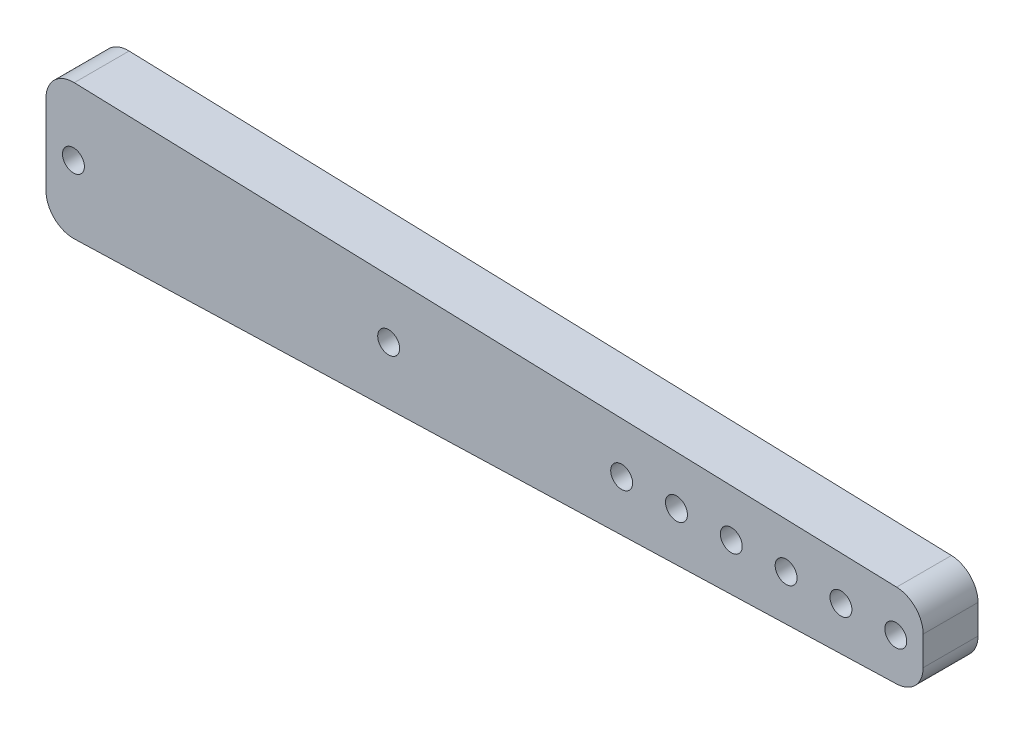
ISO-10303-21;
HEADER;
FILE_DESCRIPTION(('STEP AP214'),'2;1');
FILE_NAME('part.step','',(''),(''),'','','');
FILE_SCHEMA(('AUTOMOTIVE_DESIGN { 1 0 10303 214 1 1 1 1 }'));
ENDSEC;
DATA;
#1=APPLICATION_CONTEXT('core data for automotive mechanical design processes');
#2=APPLICATION_PROTOCOL_DEFINITION('international standard','automotive_design',2000,#1);
#3=PRODUCT_CONTEXT('',#1,'mechanical');
#4=PRODUCT('Part','Part','',(#3));
#5=PRODUCT_RELATED_PRODUCT_CATEGORY('part','',(#4));
#6=PRODUCT_DEFINITION_FORMATION('','',#4);
#7=PRODUCT_DEFINITION_CONTEXT('part definition',#1,'design');
#8=PRODUCT_DEFINITION('design','',#6,#7);
#9=PRODUCT_DEFINITION_SHAPE('','',#8);
#10=(LENGTH_UNIT() NAMED_UNIT(*) SI_UNIT(.MILLI.,.METRE.));
#11=(NAMED_UNIT(*) PLANE_ANGLE_UNIT() SI_UNIT($,.RADIAN.));
#12=(NAMED_UNIT(*) SI_UNIT($,.STERADIAN.) SOLID_ANGLE_UNIT());
#13=UNCERTAINTY_MEASURE_WITH_UNIT(LENGTH_MEASURE(1.E-05),#10,'distance_accuracy_value','');
#14=(GEOMETRIC_REPRESENTATION_CONTEXT(3) GLOBAL_UNCERTAINTY_ASSIGNED_CONTEXT((#13)) GLOBAL_UNIT_ASSIGNED_CONTEXT((#10,
#11,#12)) REPRESENTATION_CONTEXT('',''));
#15=CARTESIAN_POINT('',(0.,0.,0.));
#16=DIRECTION('',(0.,0.,1.));
#17=DIRECTION('',(1.,0.,0.));
#18=AXIS2_PLACEMENT_3D('',#15,#16,#17);
#19=CARTESIAN_POINT('',(0.,15.875,6.35));
#20=DIRECTION('',(1.,0.,0.));
#21=DIRECTION('',(0.,1.,0.));
#22=AXIS2_PLACEMENT_3D('',#19,#20,#21);
#23=PLANE('',#22);
#24=DIRECTION('',(0.,-1.,0.));
#25=VECTOR('',#24,1.);
#26=CARTESIAN_POINT('',(0.,15.875,0.));
#27=LINE('',#26,#25);
#28=CARTESIAN_POINT('',(0.,12.5992313353361,0.));
#29=VERTEX_POINT('',#28);
#30=CARTESIAN_POINT('',(0.,3.27576866466395,0.));
#31=VERTEX_POINT('',#30);
#32=EDGE_CURVE('E182',#29,#31,#27,.T.);
#33=ORIENTED_EDGE('',*,*,#32,.T.);
#34=DIRECTION('',(0.,0.,-1.));
#35=VECTOR('',#34,1.);
#36=CARTESIAN_POINT('',(0.,3.27576866466395,6.35));
#37=LINE('',#36,#35);
#38=CARTESIAN_POINT('',(0.,3.27576866466395,6.35));
#39=VERTEX_POINT('',#38);
#40=EDGE_CURVE('E11',#31,#39,#37,.F.);
#41=ORIENTED_EDGE('',*,*,#40,.T.);
#42=DIRECTION('',(0.,-1.,0.));
#43=VECTOR('',#42,1.);
#44=CARTESIAN_POINT('',(0.,15.875,6.35));
#45=LINE('',#44,#43);
#46=CARTESIAN_POINT('',(0.,12.5992313353361,6.35));
#47=VERTEX_POINT('',#46);
#48=EDGE_CURVE('E126',#47,#39,#45,.T.);
#49=ORIENTED_EDGE('',*,*,#48,.F.);
#50=DIRECTION('',(0.,0.,-1.));
#51=VECTOR('',#50,1.);
#52=CARTESIAN_POINT('',(0.,12.5992313353361,6.35));
#53=LINE('',#52,#51);
#54=EDGE_CURVE('E41',#47,#29,#53,.T.);
#55=ORIENTED_EDGE('',*,*,#54,.T.);
#56=EDGE_LOOP('',(#33,#41,#49,#55));
#57=FACE_BOUND('',#56,.T.);
#58=ADVANCED_FACE('F33',(#57),#23,.F.);
#59=CARTESIAN_POINT('',(0.,0.,6.35));
#60=DIRECTION('',(-0.0312347523777212,0.999512076087079,0.));
#61=DIRECTION('',(-0.999512076087079,-0.0312347523777212,0.));
#62=AXIS2_PLACEMENT_3D('',#59,#60,#61);
#63=PLANE('',#62);
#64=DIRECTION('',(0.999512076087079,0.0312347523777212,0.));
#65=VECTOR('',#64,1.);
#66=CARTESIAN_POINT('',(0.,0.,0.));
#67=LINE('',#66,#65);
#68=CARTESIAN_POINT('',(3.27417033879926,0.102317823087477,0.));
#69=VERTEX_POINT('',#68);
#70=CARTESIAN_POINT('',(98.5241703387993,3.07888032308748,0.));
#71=VERTEX_POINT('',#70);
#72=EDGE_CURVE('E131',#69,#71,#67,.T.);
#73=ORIENTED_EDGE('',*,*,#72,.T.);
#74=DIRECTION('',(0.,0.,-1.));
#75=VECTOR('',#74,1.);
#76=CARTESIAN_POINT('',(98.5241703387993,3.07888032308748,6.35));
#77=LINE('',#76,#75);
#78=CARTESIAN_POINT('',(98.5241703387993,3.07888032308748,6.35));
#79=VERTEX_POINT('',#78);
#80=EDGE_CURVE('E48',#71,#79,#77,.F.);
#81=ORIENTED_EDGE('',*,*,#80,.T.);
#82=DIRECTION('',(0.999512076087079,0.0312347523777212,0.));
#83=VECTOR('',#82,1.);
#84=CARTESIAN_POINT('',(0.,0.,6.35));
#85=LINE('',#84,#83);
#86=CARTESIAN_POINT('',(3.27417033879926,0.102317823087477,6.35));
#87=VERTEX_POINT('',#86);
#88=EDGE_CURVE('E129',#87,#79,#85,.T.);
#89=ORIENTED_EDGE('',*,*,#88,.F.);
#90=DIRECTION('',(0.,0.,-1.));
#91=VECTOR('',#90,1.);
#92=CARTESIAN_POINT('',(3.27417033879926,0.102317823087477,6.35));
#93=LINE('',#92,#91);
#94=EDGE_CURVE('E174',#87,#69,#93,.T.);
#95=ORIENTED_EDGE('',*,*,#94,.T.);
#96=EDGE_LOOP('',(#73,#81,#89,#95));
#97=FACE_BOUND('',#96,.T.);
#98=ADVANCED_FACE('F264',(#97),#63,.F.);
#99=CARTESIAN_POINT('',(101.6,3.175,6.35));
#100=DIRECTION('',(-1.,0.,0.));
#101=DIRECTION('',(0.,0.,1.));
#102=AXIS2_PLACEMENT_3D('',#99,#100,#101);
#103=PLANE('',#102);
#104=DIRECTION('',(0.,1.,0.));
#105=VECTOR('',#104,1.);
#106=CARTESIAN_POINT('',(101.6,3.175,0.));
#107=LINE('',#106,#105);
#108=CARTESIAN_POINT('',(101.6,6.25233116466395,0.));
#109=VERTEX_POINT('',#108);
#110=CARTESIAN_POINT('',(101.6,9.62266883533605,0.));
#111=VERTEX_POINT('',#110);
#112=EDGE_CURVE('E127',#109,#111,#107,.T.);
#113=ORIENTED_EDGE('',*,*,#112,.T.);
#114=DIRECTION('',(0.,0.,-1.));
#115=VECTOR('',#114,1.);
#116=CARTESIAN_POINT('',(101.6,9.62266883533605,6.35));
#117=LINE('',#116,#115);
#118=CARTESIAN_POINT('',(101.6,9.62266883533605,6.35));
#119=VERTEX_POINT('',#118);
#120=EDGE_CURVE('E104',#111,#119,#117,.F.);
#121=ORIENTED_EDGE('',*,*,#120,.T.);
#122=DIRECTION('',(0.,1.,0.));
#123=VECTOR('',#122,1.);
#124=CARTESIAN_POINT('',(101.6,3.175,6.35));
#125=LINE('',#124,#123);
#126=CARTESIAN_POINT('',(101.6,6.25233116466395,6.35));
#127=VERTEX_POINT('',#126);
#128=EDGE_CURVE('E194',#127,#119,#125,.T.);
#129=ORIENTED_EDGE('',*,*,#128,.F.);
#130=DIRECTION('',(0.,0.,-1.));
#131=VECTOR('',#130,1.);
#132=CARTESIAN_POINT('',(101.6,6.25233116466395,6.35));
#133=LINE('',#132,#131);
#134=EDGE_CURVE('E109',#127,#109,#133,.T.);
#135=ORIENTED_EDGE('',*,*,#134,.T.);
#136=EDGE_LOOP('',(#113,#121,#129,#135));
#137=FACE_BOUND('',#136,.T.);
#138=ADVANCED_FACE('F270',(#137),#103,.F.);
#139=CARTESIAN_POINT('',(101.6,12.7,6.35));
#140=DIRECTION('',(-0.0312347523777212,-0.999512076087079,0.));
#141=DIRECTION('',(0.999512076087079,-0.0312347523777212,0.));
#142=AXIS2_PLACEMENT_3D('',#139,#140,#141);
#143=PLANE('',#142);
#144=DIRECTION('',(-0.999512076087079,0.0312347523777212,0.));
#145=VECTOR('',#144,1.);
#146=CARTESIAN_POINT('',(101.6,12.7,6.35));
#147=LINE('',#146,#145);
#148=CARTESIAN_POINT('',(98.5241703387993,12.7961196769125,6.35));
#149=VERTEX_POINT('',#148);
#150=CARTESIAN_POINT('',(3.27417033879929,15.7726821769125,6.35));
#151=VERTEX_POINT('',#150);
#152=EDGE_CURVE('E119',#149,#151,#147,.T.);
#153=ORIENTED_EDGE('',*,*,#152,.F.);
#154=DIRECTION('',(0.,0.,-1.));
#155=VECTOR('',#154,1.);
#156=CARTESIAN_POINT('',(98.5241703387993,12.7961196769125,6.35));
#157=LINE('',#156,#155);
#158=CARTESIAN_POINT('',(98.5241703387993,12.7961196769125,0.));
#159=VERTEX_POINT('',#158);
#160=EDGE_CURVE('E103',#149,#159,#157,.T.);
#161=ORIENTED_EDGE('',*,*,#160,.T.);
#162=DIRECTION('',(-0.999512076087079,0.0312347523777212,0.));
#163=VECTOR('',#162,1.);
#164=CARTESIAN_POINT('',(101.6,12.7,0.));
#165=LINE('',#164,#163);
#166=CARTESIAN_POINT('',(3.27417033879929,15.7726821769125,0.));
#167=VERTEX_POINT('',#166);
#168=EDGE_CURVE('E116',#159,#167,#165,.T.);
#169=ORIENTED_EDGE('',*,*,#168,.T.);
#170=DIRECTION('',(0.,0.,-1.));
#171=VECTOR('',#170,1.);
#172=CARTESIAN_POINT('',(3.27417033879926,15.7726821769125,6.35));
#173=LINE('',#172,#171);
#174=EDGE_CURVE('E121',#167,#151,#173,.F.);
#175=ORIENTED_EDGE('',*,*,#174,.T.);
#176=EDGE_LOOP('',(#153,#161,#169,#175));
#177=FACE_BOUND('',#176,.T.);
#178=ADVANCED_FACE('F115',(#177),#143,.F.);
#179=CARTESIAN_POINT('',(0.,0.,6.35));
#180=DIRECTION('',(0.,0.,1.));
#181=DIRECTION('',(1.,0.,0.));
#182=AXIS2_PLACEMENT_3D('',#179,#180,#181);
#183=PLANE('',#182);
#184=CARTESIAN_POINT('',(39.6875,7.9375,6.35));
#185=DIRECTION('',(0.,0.,1.));
#186=DIRECTION('',(1.,0.,0.));
#187=AXIS2_PLACEMENT_3D('',#184,#185,#186);
#188=CIRCLE('',#187,1.27);
#189=CARTESIAN_POINT('',(40.9575,7.9375,6.35));
#190=VERTEX_POINT('',#189);
#191=EDGE_CURVE('E213',#190,#190,#188,.T.);
#192=ORIENTED_EDGE('',*,*,#191,.F.);
#193=EDGE_LOOP('',(#192));
#194=FACE_BOUND('',#193,.T.);
#195=CARTESIAN_POINT('',(3.175,7.9375,6.35));
#196=DIRECTION('',(0.,0.,1.));
#197=DIRECTION('',(1.,0.,0.));
#198=AXIS2_PLACEMENT_3D('',#195,#196,#197);
#199=CIRCLE('',#198,1.27);
#200=CARTESIAN_POINT('',(4.445,7.9375,6.35));
#201=VERTEX_POINT('',#200);
#202=EDGE_CURVE('E207',#201,#201,#199,.T.);
#203=ORIENTED_EDGE('',*,*,#202,.F.);
#204=EDGE_LOOP('',(#203));
#205=FACE_BOUND('',#204,.T.);
#206=CARTESIAN_POINT('',(92.075,7.9375,6.35));
#207=DIRECTION('',(0.,0.,1.));
#208=DIRECTION('',(1.,0.,0.));
#209=AXIS2_PLACEMENT_3D('',#206,#207,#208);
#210=CIRCLE('',#209,1.26999999999999);
#211=CARTESIAN_POINT('',(93.345,7.9375,6.35));
#212=VERTEX_POINT('',#211);
#213=EDGE_CURVE('E199',#212,#212,#210,.T.);
#214=ORIENTED_EDGE('',*,*,#213,.F.);
#215=EDGE_LOOP('',(#214));
#216=FACE_BOUND('',#215,.T.);
#217=CARTESIAN_POINT('',(98.425,7.9375,6.35));
#218=DIRECTION('',(0.,0.,1.));
#219=DIRECTION('',(1.,0.,0.));
#220=AXIS2_PLACEMENT_3D('',#217,#218,#219);
#221=CIRCLE('',#220,1.26999999999999);
#222=CARTESIAN_POINT('',(99.695,7.9375,6.35));
#223=VERTEX_POINT('',#222);
#224=EDGE_CURVE('E190',#223,#223,#221,.T.);
#225=ORIENTED_EDGE('',*,*,#224,.F.);
#226=EDGE_LOOP('',(#225));
#227=FACE_BOUND('',#226,.T.);
#228=ORIENTED_EDGE('',*,*,#128,.T.);
#229=CARTESIAN_POINT('',(98.425,9.62266883533605,6.35));
#230=DIRECTION('',(0.,0.,1.));
#231=DIRECTION('',(1.,0.,0.));
#232=AXIS2_PLACEMENT_3D('',#229,#230,#231);
#233=CIRCLE('',#232,3.175);
#234=EDGE_CURVE('E172',#119,#149,#233,.T.);
#235=ORIENTED_EDGE('',*,*,#234,.T.);
#236=ORIENTED_EDGE('',*,*,#152,.T.);
#237=CARTESIAN_POINT('',(3.175,12.5992313353361,6.35));
#238=DIRECTION('',(0.,0.,1.));
#239=DIRECTION('',(1.,0.,0.));
#240=AXIS2_PLACEMENT_3D('',#237,#238,#239);
#241=CIRCLE('',#240,3.175);
#242=EDGE_CURVE('E167',#151,#47,#241,.T.);
#243=ORIENTED_EDGE('',*,*,#242,.T.);
#244=ORIENTED_EDGE('',*,*,#48,.T.);
#245=CARTESIAN_POINT('',(3.175,3.27576866466395,6.35));
#246=DIRECTION('',(0.,0.,1.));
#247=DIRECTION('',(1.,0.,0.));
#248=AXIS2_PLACEMENT_3D('',#245,#246,#247);
#249=CIRCLE('',#248,3.175);
#250=EDGE_CURVE('E55',#39,#87,#249,.T.);
#251=ORIENTED_EDGE('',*,*,#250,.T.);
#252=ORIENTED_EDGE('',*,*,#88,.T.);
#253=CARTESIAN_POINT('',(98.425,6.25233116466395,6.35));
#254=DIRECTION('',(0.,0.,1.));
#255=DIRECTION('',(1.,0.,0.));
#256=AXIS2_PLACEMENT_3D('',#253,#254,#255);
#257=CIRCLE('',#256,3.175);
#258=EDGE_CURVE('E170',#79,#127,#257,.T.);
#259=ORIENTED_EDGE('',*,*,#258,.T.);
#260=EDGE_LOOP('',(#228,#235,#236,#243,#244,#251,#252,#259));
#261=FACE_BOUND('',#260,.T.);
#262=CARTESIAN_POINT('',(85.725,7.9375,6.35));
#263=DIRECTION('',(0.,0.,1.));
#264=DIRECTION('',(1.,0.,0.));
#265=AXIS2_PLACEMENT_3D('',#262,#263,#264);
#266=CIRCLE('',#265,1.26999999999999);
#267=CARTESIAN_POINT('',(86.995,7.9375,6.35));
#268=VERTEX_POINT('',#267);
#269=EDGE_CURVE('E138',#268,#268,#266,.T.);
#270=ORIENTED_EDGE('',*,*,#269,.F.);
#271=EDGE_LOOP('',(#270));
#272=FACE_BOUND('',#271,.T.);
#273=CARTESIAN_POINT('',(79.375,7.9375,6.35));
#274=DIRECTION('',(0.,0.,1.));
#275=DIRECTION('',(1.,0.,0.));
#276=AXIS2_PLACEMENT_3D('',#273,#274,#275);
#277=CIRCLE('',#276,1.26999999999999);
#278=CARTESIAN_POINT('',(80.645,7.9375,6.35));
#279=VERTEX_POINT('',#278);
#280=EDGE_CURVE('E144',#279,#279,#277,.T.);
#281=ORIENTED_EDGE('',*,*,#280,.F.);
#282=EDGE_LOOP('',(#281));
#283=FACE_BOUND('',#282,.T.);
#284=CARTESIAN_POINT('',(73.025,7.9375,6.35));
#285=DIRECTION('',(0.,0.,1.));
#286=DIRECTION('',(1.,0.,0.));
#287=AXIS2_PLACEMENT_3D('',#284,#285,#286);
#288=CIRCLE('',#287,1.26999999999999);
#289=CARTESIAN_POINT('',(74.295,7.9375,6.35));
#290=VERTEX_POINT('',#289);
#291=EDGE_CURVE('E150',#290,#290,#288,.T.);
#292=ORIENTED_EDGE('',*,*,#291,.F.);
#293=EDGE_LOOP('',(#292));
#294=FACE_BOUND('',#293,.T.);
#295=CARTESIAN_POINT('',(66.675,7.9375,6.35));
#296=DIRECTION('',(0.,0.,1.));
#297=DIRECTION('',(1.,0.,0.));
#298=AXIS2_PLACEMENT_3D('',#295,#296,#297);
#299=CIRCLE('',#298,1.26999999999999);
#300=CARTESIAN_POINT('',(67.945,7.9375,6.35));
#301=VERTEX_POINT('',#300);
#302=EDGE_CURVE('E156',#301,#301,#299,.T.);
#303=ORIENTED_EDGE('',*,*,#302,.F.);
#304=EDGE_LOOP('',(#303));
#305=FACE_BOUND('',#304,.T.);
#306=ADVANCED_FACE('F228',(#194,#205,#216,#227,#261,#272,#283,#294,#305),#183,.T.);
#307=CARTESIAN_POINT('',(0.,0.,0.));
#308=DIRECTION('',(0.,0.,1.));
#309=DIRECTION('',(1.,0.,0.));
#310=AXIS2_PLACEMENT_3D('',#307,#308,#309);
#311=PLANE('',#310);
#312=CARTESIAN_POINT('',(39.6875,7.9375,0.));
#313=DIRECTION('',(0.,0.,1.));
#314=DIRECTION('',(1.,0.,0.));
#315=AXIS2_PLACEMENT_3D('',#312,#313,#314);
#316=CIRCLE('',#315,1.27);
#317=CARTESIAN_POINT('',(40.9575,7.9375,0.));
#318=VERTEX_POINT('',#317);
#319=EDGE_CURVE('E210',#318,#318,#316,.T.);
#320=ORIENTED_EDGE('',*,*,#319,.T.);
#321=EDGE_LOOP('',(#320));
#322=FACE_BOUND('',#321,.T.);
#323=CARTESIAN_POINT('',(3.175,7.9375,0.));
#324=DIRECTION('',(0.,0.,1.));
#325=DIRECTION('',(1.,0.,0.));
#326=AXIS2_PLACEMENT_3D('',#323,#324,#325);
#327=CIRCLE('',#326,1.27);
#328=CARTESIAN_POINT('',(4.445,7.9375,0.));
#329=VERTEX_POINT('',#328);
#330=EDGE_CURVE('E206',#329,#329,#327,.T.);
#331=ORIENTED_EDGE('',*,*,#330,.T.);
#332=EDGE_LOOP('',(#331));
#333=FACE_BOUND('',#332,.T.);
#334=CARTESIAN_POINT('',(92.075,7.9375,0.));
#335=DIRECTION('',(0.,0.,1.));
#336=DIRECTION('',(1.,0.,0.));
#337=AXIS2_PLACEMENT_3D('',#334,#335,#336);
#338=CIRCLE('',#337,1.26999999999999);
#339=CARTESIAN_POINT('',(93.345,7.9375,0.));
#340=VERTEX_POINT('',#339);
#341=EDGE_CURVE('E203',#340,#340,#338,.T.);
#342=ORIENTED_EDGE('',*,*,#341,.T.);
#343=EDGE_LOOP('',(#342));
#344=FACE_BOUND('',#343,.T.);
#345=CARTESIAN_POINT('',(98.425,7.9375,0.));
#346=DIRECTION('',(0.,0.,1.));
#347=DIRECTION('',(1.,0.,0.));
#348=AXIS2_PLACEMENT_3D('',#345,#346,#347);
#349=CIRCLE('',#348,1.26999999999999);
#350=CARTESIAN_POINT('',(99.695,7.9375,0.));
#351=VERTEX_POINT('',#350);
#352=EDGE_CURVE('E187',#351,#351,#349,.T.);
#353=ORIENTED_EDGE('',*,*,#352,.T.);
#354=EDGE_LOOP('',(#353));
#355=FACE_BOUND('',#354,.T.);
#356=ORIENTED_EDGE('',*,*,#168,.F.);
#357=CARTESIAN_POINT('',(98.425,9.62266883533605,0.));
#358=DIRECTION('',(0.,0.,1.));
#359=DIRECTION('',(1.,0.,0.));
#360=AXIS2_PLACEMENT_3D('',#357,#358,#359);
#361=CIRCLE('',#360,3.175);
#362=EDGE_CURVE('E99',#159,#111,#361,.F.);
#363=ORIENTED_EDGE('',*,*,#362,.T.);
#364=ORIENTED_EDGE('',*,*,#112,.F.);
#365=CARTESIAN_POINT('',(98.425,6.25233116466395,0.));
#366=DIRECTION('',(0.,0.,1.));
#367=DIRECTION('',(1.,0.,0.));
#368=AXIS2_PLACEMENT_3D('',#365,#366,#367);
#369=CIRCLE('',#368,3.175);
#370=EDGE_CURVE('E110',#109,#71,#369,.F.);
#371=ORIENTED_EDGE('',*,*,#370,.T.);
#372=ORIENTED_EDGE('',*,*,#72,.F.);
#373=CARTESIAN_POINT('',(3.175,3.27576866466395,0.));
#374=DIRECTION('',(0.,0.,1.));
#375=DIRECTION('',(1.,0.,0.));
#376=AXIS2_PLACEMENT_3D('',#373,#374,#375);
#377=CIRCLE('',#376,3.175);
#378=EDGE_CURVE('E161',#69,#31,#377,.F.);
#379=ORIENTED_EDGE('',*,*,#378,.T.);
#380=ORIENTED_EDGE('',*,*,#32,.F.);
#381=CARTESIAN_POINT('',(3.175,12.5992313353361,0.));
#382=DIRECTION('',(0.,0.,1.));
#383=DIRECTION('',(1.,0.,0.));
#384=AXIS2_PLACEMENT_3D('',#381,#382,#383);
#385=CIRCLE('',#384,3.175);
#386=EDGE_CURVE('E120',#29,#167,#385,.F.);
#387=ORIENTED_EDGE('',*,*,#386,.T.);
#388=EDGE_LOOP('',(#356,#363,#364,#371,#372,#379,#380,#387));
#389=FACE_BOUND('',#388,.T.);
#390=CARTESIAN_POINT('',(85.725,7.9375,0.));
#391=DIRECTION('',(0.,0.,1.));
#392=DIRECTION('',(1.,0.,0.));
#393=AXIS2_PLACEMENT_3D('',#390,#391,#392);
#394=CIRCLE('',#393,1.26999999999999);
#395=CARTESIAN_POINT('',(86.995,7.9375,0.));
#396=VERTEX_POINT('',#395);
#397=EDGE_CURVE('E135',#396,#396,#394,.T.);
#398=ORIENTED_EDGE('',*,*,#397,.T.);
#399=EDGE_LOOP('',(#398));
#400=FACE_BOUND('',#399,.T.);
#401=CARTESIAN_POINT('',(79.375,7.9375,0.));
#402=DIRECTION('',(0.,0.,1.));
#403=DIRECTION('',(1.,0.,0.));
#404=AXIS2_PLACEMENT_3D('',#401,#402,#403);
#405=CIRCLE('',#404,1.26999999999999);
#406=CARTESIAN_POINT('',(80.645,7.9375,0.));
#407=VERTEX_POINT('',#406);
#408=EDGE_CURVE('E141',#407,#407,#405,.T.);
#409=ORIENTED_EDGE('',*,*,#408,.T.);
#410=EDGE_LOOP('',(#409));
#411=FACE_BOUND('',#410,.T.);
#412=CARTESIAN_POINT('',(73.025,7.9375,0.));
#413=DIRECTION('',(0.,0.,1.));
#414=DIRECTION('',(1.,0.,0.));
#415=AXIS2_PLACEMENT_3D('',#412,#413,#414);
#416=CIRCLE('',#415,1.26999999999999);
#417=CARTESIAN_POINT('',(74.295,7.9375,0.));
#418=VERTEX_POINT('',#417);
#419=EDGE_CURVE('E147',#418,#418,#416,.T.);
#420=ORIENTED_EDGE('',*,*,#419,.T.);
#421=EDGE_LOOP('',(#420));
#422=FACE_BOUND('',#421,.T.);
#423=CARTESIAN_POINT('',(66.675,7.9375,0.));
#424=DIRECTION('',(0.,0.,1.));
#425=DIRECTION('',(1.,0.,0.));
#426=AXIS2_PLACEMENT_3D('',#423,#424,#425);
#427=CIRCLE('',#426,1.26999999999999);
#428=CARTESIAN_POINT('',(67.945,7.9375,0.));
#429=VERTEX_POINT('',#428);
#430=EDGE_CURVE('E153',#429,#429,#427,.T.);
#431=ORIENTED_EDGE('',*,*,#430,.T.);
#432=EDGE_LOOP('',(#431));
#433=FACE_BOUND('',#432,.T.);
#434=ADVANCED_FACE('F123',(#322,#333,#344,#355,#389,#400,#411,#422,#433),#311,.F.);
#435=CARTESIAN_POINT('',(98.425,7.9375,0.));
#436=DIRECTION('',(0.,0.,1.));
#437=DIRECTION('',(1.,0.,0.));
#438=AXIS2_PLACEMENT_3D('',#435,#436,#437);
#439=CYLINDRICAL_SURFACE('',#438,1.26999999999999);
#440=ORIENTED_EDGE('',*,*,#352,.F.);
#441=EDGE_LOOP('',(#440));
#442=FACE_BOUND('',#441,.T.);
#443=ORIENTED_EDGE('',*,*,#224,.T.);
#444=EDGE_LOOP('',(#443));
#445=FACE_BOUND('',#444,.T.);
#446=ADVANCED_FACE('F288',(#442,#445),#439,.F.);
#447=CARTESIAN_POINT('',(92.075,7.9375,0.));
#448=DIRECTION('',(0.,0.,1.));
#449=DIRECTION('',(1.,0.,0.));
#450=AXIS2_PLACEMENT_3D('',#447,#448,#449);
#451=CYLINDRICAL_SURFACE('',#450,1.26999999999999);
#452=ORIENTED_EDGE('',*,*,#341,.F.);
#453=EDGE_LOOP('',(#452));
#454=FACE_BOUND('',#453,.T.);
#455=ORIENTED_EDGE('',*,*,#213,.T.);
#456=EDGE_LOOP('',(#455));
#457=FACE_BOUND('',#456,.T.);
#458=ADVANCED_FACE('F277',(#454,#457),#451,.F.);
#459=CARTESIAN_POINT('',(85.725,7.9375,0.));
#460=DIRECTION('',(0.,0.,1.));
#461=DIRECTION('',(1.,0.,0.));
#462=AXIS2_PLACEMENT_3D('',#459,#460,#461);
#463=CYLINDRICAL_SURFACE('',#462,1.26999999999999);
#464=ORIENTED_EDGE('',*,*,#397,.F.);
#465=EDGE_LOOP('',(#464));
#466=FACE_BOUND('',#465,.T.);
#467=ORIENTED_EDGE('',*,*,#269,.T.);
#468=EDGE_LOOP('',(#467));
#469=FACE_BOUND('',#468,.T.);
#470=ADVANCED_FACE('F274',(#466,#469),#463,.F.);
#471=CARTESIAN_POINT('',(79.375,7.9375,0.));
#472=DIRECTION('',(0.,0.,1.));
#473=DIRECTION('',(1.,0.,0.));
#474=AXIS2_PLACEMENT_3D('',#471,#472,#473);
#475=CYLINDRICAL_SURFACE('',#474,1.26999999999999);
#476=ORIENTED_EDGE('',*,*,#408,.F.);
#477=EDGE_LOOP('',(#476));
#478=FACE_BOUND('',#477,.T.);
#479=ORIENTED_EDGE('',*,*,#280,.T.);
#480=EDGE_LOOP('',(#479));
#481=FACE_BOUND('',#480,.T.);
#482=ADVANCED_FACE('F258',(#478,#481),#475,.F.);
#483=CARTESIAN_POINT('',(73.025,7.9375,0.));
#484=DIRECTION('',(0.,0.,1.));
#485=DIRECTION('',(1.,0.,0.));
#486=AXIS2_PLACEMENT_3D('',#483,#484,#485);
#487=CYLINDRICAL_SURFACE('',#486,1.26999999999999);
#488=ORIENTED_EDGE('',*,*,#419,.F.);
#489=EDGE_LOOP('',(#488));
#490=FACE_BOUND('',#489,.T.);
#491=ORIENTED_EDGE('',*,*,#291,.T.);
#492=EDGE_LOOP('',(#491));
#493=FACE_BOUND('',#492,.T.);
#494=ADVANCED_FACE('F249',(#490,#493),#487,.F.);
#495=CARTESIAN_POINT('',(66.675,7.9375,0.));
#496=DIRECTION('',(0.,0.,1.));
#497=DIRECTION('',(1.,0.,0.));
#498=AXIS2_PLACEMENT_3D('',#495,#496,#497);
#499=CYLINDRICAL_SURFACE('',#498,1.26999999999999);
#500=ORIENTED_EDGE('',*,*,#430,.F.);
#501=EDGE_LOOP('',(#500));
#502=FACE_BOUND('',#501,.T.);
#503=ORIENTED_EDGE('',*,*,#302,.T.);
#504=EDGE_LOOP('',(#503));
#505=FACE_BOUND('',#504,.T.);
#506=ADVANCED_FACE('F247',(#502,#505),#499,.F.);
#507=CARTESIAN_POINT('',(3.175,7.9375,0.));
#508=DIRECTION('',(0.,0.,1.));
#509=DIRECTION('',(1.,0.,0.));
#510=AXIS2_PLACEMENT_3D('',#507,#508,#509);
#511=CYLINDRICAL_SURFACE('',#510,1.27);
#512=ORIENTED_EDGE('',*,*,#330,.F.);
#513=EDGE_LOOP('',(#512));
#514=FACE_BOUND('',#513,.T.);
#515=ORIENTED_EDGE('',*,*,#202,.T.);
#516=EDGE_LOOP('',(#515));
#517=FACE_BOUND('',#516,.T.);
#518=ADVANCED_FACE('F224',(#514,#517),#511,.F.);
#519=CARTESIAN_POINT('',(39.6875,7.9375,0.));
#520=DIRECTION('',(0.,0.,1.));
#521=DIRECTION('',(1.,0.,0.));
#522=AXIS2_PLACEMENT_3D('',#519,#520,#521);
#523=CYLINDRICAL_SURFACE('',#522,1.27);
#524=ORIENTED_EDGE('',*,*,#319,.F.);
#525=EDGE_LOOP('',(#524));
#526=FACE_BOUND('',#525,.T.);
#527=ORIENTED_EDGE('',*,*,#191,.T.);
#528=EDGE_LOOP('',(#527));
#529=FACE_BOUND('',#528,.T.);
#530=ADVANCED_FACE('F221',(#526,#529),#523,.F.);
#531=CARTESIAN_POINT('',(98.425,9.62266883533605,6.35));
#532=DIRECTION('',(0.,0.,-1.));
#533=DIRECTION('',(-1.,0.,0.));
#534=AXIS2_PLACEMENT_3D('',#531,#532,#533);
#535=CYLINDRICAL_SURFACE('',#534,3.175);
#536=ORIENTED_EDGE('',*,*,#234,.F.);
#537=ORIENTED_EDGE('',*,*,#120,.F.);
#538=ORIENTED_EDGE('',*,*,#362,.F.);
#539=ORIENTED_EDGE('',*,*,#160,.F.);
#540=EDGE_LOOP('',(#536,#537,#538,#539));
#541=FACE_BOUND('',#540,.T.);
#542=ADVANCED_FACE('F102',(#541),#535,.T.);
#543=CARTESIAN_POINT('',(98.425,6.25233116466395,6.35));
#544=DIRECTION('',(0.,0.,-1.));
#545=DIRECTION('',(-1.,0.,0.));
#546=AXIS2_PLACEMENT_3D('',#543,#544,#545);
#547=CYLINDRICAL_SURFACE('',#546,3.175);
#548=ORIENTED_EDGE('',*,*,#258,.F.);
#549=ORIENTED_EDGE('',*,*,#80,.F.);
#550=ORIENTED_EDGE('',*,*,#370,.F.);
#551=ORIENTED_EDGE('',*,*,#134,.F.);
#552=EDGE_LOOP('',(#548,#549,#550,#551));
#553=FACE_BOUND('',#552,.T.);
#554=ADVANCED_FACE('F309',(#553),#547,.T.);
#555=CARTESIAN_POINT('',(3.175,3.27576866466395,6.35));
#556=DIRECTION('',(0.,0.,-1.));
#557=DIRECTION('',(-1.,0.,0.));
#558=AXIS2_PLACEMENT_3D('',#555,#556,#557);
#559=CYLINDRICAL_SURFACE('',#558,3.175);
#560=ORIENTED_EDGE('',*,*,#250,.F.);
#561=ORIENTED_EDGE('',*,*,#40,.F.);
#562=ORIENTED_EDGE('',*,*,#378,.F.);
#563=ORIENTED_EDGE('',*,*,#94,.F.);
#564=EDGE_LOOP('',(#560,#561,#562,#563));
#565=FACE_BOUND('',#564,.T.);
#566=ADVANCED_FACE('F311',(#565),#559,.T.);
#567=CARTESIAN_POINT('',(3.175,12.5992313353361,6.35));
#568=DIRECTION('',(0.,0.,-1.));
#569=DIRECTION('',(-1.,0.,0.));
#570=AXIS2_PLACEMENT_3D('',#567,#568,#569);
#571=CYLINDRICAL_SURFACE('',#570,3.175);
#572=ORIENTED_EDGE('',*,*,#242,.F.);
#573=ORIENTED_EDGE('',*,*,#174,.F.);
#574=ORIENTED_EDGE('',*,*,#386,.F.);
#575=ORIENTED_EDGE('',*,*,#54,.F.);
#576=EDGE_LOOP('',(#572,#573,#574,#575));
#577=FACE_BOUND('',#576,.T.);
#578=ADVANCED_FACE('F35',(#577),#571,.T.);
#579=CLOSED_SHELL('',(#58,#98,#138,#178,#306,#434,#446,#458,#470,#482,#494,#506,#518,#530,#542,
#554,#566,#578));
#580=MANIFOLD_SOLID_BREP('B2',#579);
#581=ADVANCED_BREP_SHAPE_REPRESENTATION('',(#18,#580),#14);
#582=SHAPE_DEFINITION_REPRESENTATION(#9,#581);
ENDSEC;
END-ISO-10303-21;
